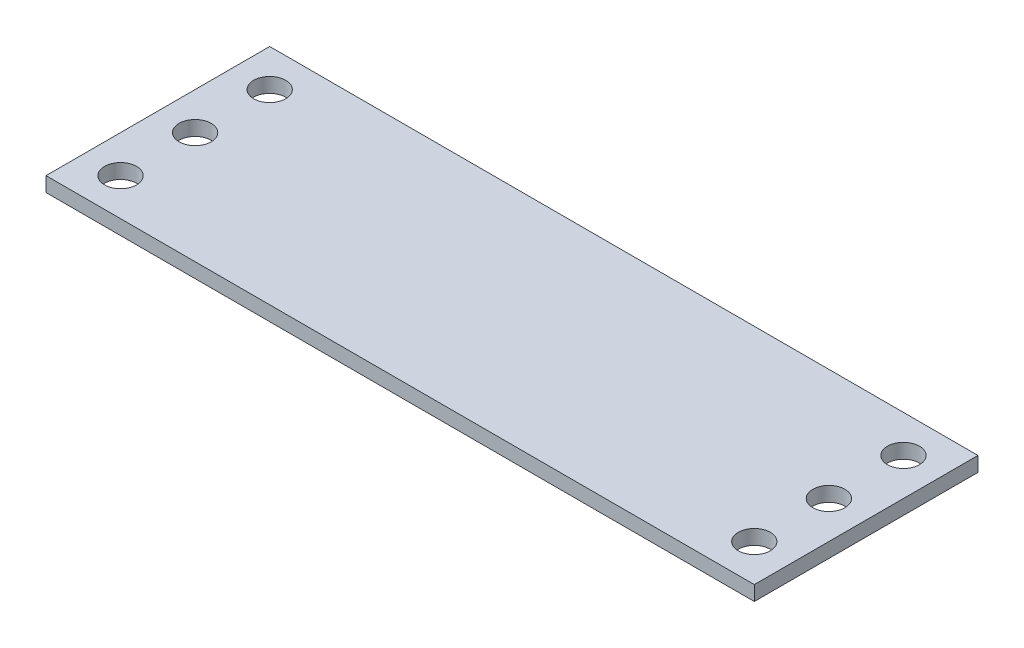
ISO-10303-21;
HEADER;
FILE_DESCRIPTION(('STEP AP214'),'2;1');
FILE_NAME('part.step','',(''),(''),'','','');
FILE_SCHEMA(('AUTOMOTIVE_DESIGN { 1 0 10303 214 1 1 1 1 }'));
ENDSEC;
DATA;
#1=APPLICATION_CONTEXT('core data for automotive mechanical design processes');
#2=APPLICATION_PROTOCOL_DEFINITION('international standard','automotive_design',2000,#1);
#3=PRODUCT_CONTEXT('',#1,'mechanical');
#4=PRODUCT('Part','Part','',(#3));
#5=PRODUCT_RELATED_PRODUCT_CATEGORY('part','',(#4));
#6=PRODUCT_DEFINITION_FORMATION('','',#4);
#7=PRODUCT_DEFINITION_CONTEXT('part definition',#1,'design');
#8=PRODUCT_DEFINITION('design','',#6,#7);
#9=PRODUCT_DEFINITION_SHAPE('','',#8);
#10=(LENGTH_UNIT() NAMED_UNIT(*) SI_UNIT(.MILLI.,.METRE.));
#11=(NAMED_UNIT(*) PLANE_ANGLE_UNIT() SI_UNIT($,.RADIAN.));
#12=(NAMED_UNIT(*) SI_UNIT($,.STERADIAN.) SOLID_ANGLE_UNIT());
#13=UNCERTAINTY_MEASURE_WITH_UNIT(LENGTH_MEASURE(1.E-05),#10,'distance_accuracy_value','');
#14=(GEOMETRIC_REPRESENTATION_CONTEXT(3) GLOBAL_UNCERTAINTY_ASSIGNED_CONTEXT((#13)) GLOBAL_UNIT_ASSIGNED_CONTEXT((#10,
#11,#12)) REPRESENTATION_CONTEXT('',''));
#15=CARTESIAN_POINT('',(0.,0.,0.));
#16=DIRECTION('',(0.,0.,1.));
#17=DIRECTION('',(1.,0.,0.));
#18=AXIS2_PLACEMENT_3D('',#15,#16,#17);
#19=CARTESIAN_POINT('',(24.13,1.,-7.62));
#20=DIRECTION('',(-1.,0.,0.));
#21=DIRECTION('',(0.,0.,1.));
#22=AXIS2_PLACEMENT_3D('',#19,#20,#21);
#23=PLANE('',#22);
#24=DIRECTION('',(0.,0.,-1.));
#25=VECTOR('',#24,1.);
#26=CARTESIAN_POINT('',(24.13,0.,-7.62));
#27=LINE('',#26,#25);
#28=CARTESIAN_POINT('',(24.13,0.,7.62));
#29=VERTEX_POINT('',#28);
#30=CARTESIAN_POINT('',(24.13,0.,-7.62));
#31=VERTEX_POINT('',#30);
#32=EDGE_CURVE('E98',#29,#31,#27,.T.);
#33=ORIENTED_EDGE('',*,*,#32,.T.);
#34=DIRECTION('',(0.,-1.,0.));
#35=VECTOR('',#34,1.);
#36=CARTESIAN_POINT('',(24.13,1.,-7.62));
#37=LINE('',#36,#35);
#38=CARTESIAN_POINT('',(24.13,1.,-7.62));
#39=VERTEX_POINT('',#38);
#40=EDGE_CURVE('E11',#39,#31,#37,.T.);
#41=ORIENTED_EDGE('',*,*,#40,.F.);
#42=DIRECTION('',(0.,0.,-1.));
#43=VECTOR('',#42,1.);
#44=CARTESIAN_POINT('',(24.13,1.,-7.62));
#45=LINE('',#44,#43);
#46=CARTESIAN_POINT('',(24.13,1.,7.62));
#47=VERTEX_POINT('',#46);
#48=EDGE_CURVE('E86',#47,#39,#45,.T.);
#49=ORIENTED_EDGE('',*,*,#48,.F.);
#50=DIRECTION('',(0.,-1.,0.));
#51=VECTOR('',#50,1.);
#52=CARTESIAN_POINT('',(24.13,1.,7.62));
#53=LINE('',#52,#51);
#54=EDGE_CURVE('E94',#47,#29,#53,.T.);
#55=ORIENTED_EDGE('',*,*,#54,.T.);
#56=EDGE_LOOP('',(#33,#41,#49,#55));
#57=FACE_BOUND('',#56,.T.);
#58=ADVANCED_FACE('F35',(#57),#23,.F.);
#59=CARTESIAN_POINT('',(-24.13,1.,-7.62));
#60=DIRECTION('',(0.,0.,1.));
#61=DIRECTION('',(1.,0.,0.));
#62=AXIS2_PLACEMENT_3D('',#59,#60,#61);
#63=PLANE('',#62);
#64=DIRECTION('',(-1.,0.,0.));
#65=VECTOR('',#64,1.);
#66=CARTESIAN_POINT('',(-24.13,0.,-7.62));
#67=LINE('',#66,#65);
#68=CARTESIAN_POINT('',(-24.13,0.,-7.62));
#69=VERTEX_POINT('',#68);
#70=EDGE_CURVE('E90',#31,#69,#67,.T.);
#71=ORIENTED_EDGE('',*,*,#70,.T.);
#72=DIRECTION('',(0.,-1.,0.));
#73=VECTOR('',#72,1.);
#74=CARTESIAN_POINT('',(-24.13,1.,-7.62));
#75=LINE('',#74,#73);
#76=CARTESIAN_POINT('',(-24.13,1.,-7.62));
#77=VERTEX_POINT('',#76);
#78=EDGE_CURVE('E43',#77,#69,#75,.T.);
#79=ORIENTED_EDGE('',*,*,#78,.F.);
#80=DIRECTION('',(-1.,0.,0.));
#81=VECTOR('',#80,1.);
#82=CARTESIAN_POINT('',(-24.13,1.,-7.62));
#83=LINE('',#82,#81);
#84=EDGE_CURVE('E81',#39,#77,#83,.T.);
#85=ORIENTED_EDGE('',*,*,#84,.F.);
#86=ORIENTED_EDGE('',*,*,#40,.T.);
#87=EDGE_LOOP('',(#71,#79,#85,#86));
#88=FACE_BOUND('',#87,.T.);
#89=ADVANCED_FACE('F89',(#88),#63,.F.);
#90=CARTESIAN_POINT('',(-24.13,1.,-7.62));
#91=DIRECTION('',(1.,0.,0.));
#92=DIRECTION('',(0.,0.,-1.));
#93=AXIS2_PLACEMENT_3D('',#90,#91,#92);
#94=PLANE('',#93);
#95=DIRECTION('',(0.,0.,1.));
#96=VECTOR('',#95,1.);
#97=CARTESIAN_POINT('',(-24.13,0.,-7.62));
#98=LINE('',#97,#96);
#99=CARTESIAN_POINT('',(-24.13,0.,7.62));
#100=VERTEX_POINT('',#99);
#101=EDGE_CURVE('E68',#69,#100,#98,.T.);
#102=ORIENTED_EDGE('',*,*,#101,.T.);
#103=DIRECTION('',(0.,-1.,0.));
#104=VECTOR('',#103,1.);
#105=CARTESIAN_POINT('',(-24.13,1.,7.62));
#106=LINE('',#105,#104);
#107=CARTESIAN_POINT('',(-24.13,1.,7.62));
#108=VERTEX_POINT('',#107);
#109=EDGE_CURVE('E91',#108,#100,#106,.T.);
#110=ORIENTED_EDGE('',*,*,#109,.F.);
#111=DIRECTION('',(0.,0.,1.));
#112=VECTOR('',#111,1.);
#113=CARTESIAN_POINT('',(-24.13,1.,-7.62));
#114=LINE('',#113,#112);
#115=EDGE_CURVE('E84',#77,#108,#114,.T.);
#116=ORIENTED_EDGE('',*,*,#115,.F.);
#117=ORIENTED_EDGE('',*,*,#78,.T.);
#118=EDGE_LOOP('',(#102,#110,#116,#117));
#119=FACE_BOUND('',#118,.T.);
#120=ADVANCED_FACE('F92',(#119),#94,.F.);
#121=CARTESIAN_POINT('',(-24.13,1.,7.62));
#122=DIRECTION('',(0.,0.,-1.));
#123=DIRECTION('',(-1.,0.,0.));
#124=AXIS2_PLACEMENT_3D('',#121,#122,#123);
#125=PLANE('',#124);
#126=DIRECTION('',(1.,0.,0.));
#127=VECTOR('',#126,1.);
#128=CARTESIAN_POINT('',(-24.13,0.,7.62));
#129=LINE('',#128,#127);
#130=EDGE_CURVE('E74',#100,#29,#129,.T.);
#131=ORIENTED_EDGE('',*,*,#130,.T.);
#132=ORIENTED_EDGE('',*,*,#54,.F.);
#133=DIRECTION('',(1.,0.,0.));
#134=VECTOR('',#133,1.);
#135=CARTESIAN_POINT('',(-24.13,1.,7.62));
#136=LINE('',#135,#134);
#137=EDGE_CURVE('E51',#108,#47,#136,.T.);
#138=ORIENTED_EDGE('',*,*,#137,.F.);
#139=ORIENTED_EDGE('',*,*,#109,.T.);
#140=EDGE_LOOP('',(#131,#132,#138,#139));
#141=FACE_BOUND('',#140,.T.);
#142=ADVANCED_FACE('F106',(#141),#125,.F.);
#143=CARTESIAN_POINT('',(24.13,1.,7.62));
#144=DIRECTION('',(0.,1.,0.));
#145=DIRECTION('',(0.,0.,1.));
#146=AXIS2_PLACEMENT_3D('',#143,#144,#145);
#147=PLANE('',#146);
#148=CARTESIAN_POINT('',(21.59,1.,-5.07999999999992));
#149=DIRECTION('',(0.,1.,0.));
#150=DIRECTION('',(0.,0.,-1.));
#151=AXIS2_PLACEMENT_3D('',#148,#149,#150);
#152=CIRCLE('',#151,1.0922);
#153=CARTESIAN_POINT('',(21.59,1.,-6.17219999999992));
#154=VERTEX_POINT('',#153);
#155=EDGE_CURVE('E142',#154,#154,#152,.T.);
#156=ORIENTED_EDGE('',*,*,#155,.F.);
#157=EDGE_LOOP('',(#156));
#158=FACE_BOUND('',#157,.T.);
#159=CARTESIAN_POINT('',(21.59,1.,0.));
#160=DIRECTION('',(0.,1.,0.));
#161=DIRECTION('',(0.,0.,-1.));
#162=AXIS2_PLACEMENT_3D('',#159,#160,#161);
#163=CIRCLE('',#162,1.0922);
#164=CARTESIAN_POINT('',(21.59,1.,-1.09219999999992));
#165=VERTEX_POINT('',#164);
#166=EDGE_CURVE('E136',#165,#165,#163,.T.);
#167=ORIENTED_EDGE('',*,*,#166,.F.);
#168=EDGE_LOOP('',(#167));
#169=FACE_BOUND('',#168,.T.);
#170=CARTESIAN_POINT('',(21.59,1.,5.08000000000008));
#171=DIRECTION('',(0.,1.,0.));
#172=DIRECTION('',(0.,0.,-1.));
#173=AXIS2_PLACEMENT_3D('',#170,#171,#172);
#174=CIRCLE('',#173,1.0922);
#175=CARTESIAN_POINT('',(21.59,1.,3.98780000000008));
#176=VERTEX_POINT('',#175);
#177=EDGE_CURVE('E130',#176,#176,#174,.T.);
#178=ORIENTED_EDGE('',*,*,#177,.F.);
#179=EDGE_LOOP('',(#178));
#180=FACE_BOUND('',#179,.T.);
#181=CARTESIAN_POINT('',(-21.59,1.,5.08));
#182=DIRECTION('',(0.,1.,0.));
#183=DIRECTION('',(0.,0.,1.));
#184=AXIS2_PLACEMENT_3D('',#181,#182,#183);
#185=CIRCLE('',#184,1.0922);
#186=CARTESIAN_POINT('',(-21.59,1.,6.1722));
#187=VERTEX_POINT('',#186);
#188=EDGE_CURVE('E124',#187,#187,#185,.T.);
#189=ORIENTED_EDGE('',*,*,#188,.F.);
#190=EDGE_LOOP('',(#189));
#191=FACE_BOUND('',#190,.T.);
#192=CARTESIAN_POINT('',(-21.59,1.,0.));
#193=DIRECTION('',(0.,1.,0.));
#194=DIRECTION('',(0.,0.,1.));
#195=AXIS2_PLACEMENT_3D('',#192,#193,#194);
#196=CIRCLE('',#195,1.0922);
#197=CARTESIAN_POINT('',(-21.59,1.,1.0922));
#198=VERTEX_POINT('',#197);
#199=EDGE_CURVE('E118',#198,#198,#196,.T.);
#200=ORIENTED_EDGE('',*,*,#199,.F.);
#201=EDGE_LOOP('',(#200));
#202=FACE_BOUND('',#201,.T.);
#203=CARTESIAN_POINT('',(-21.59,1.,-5.08));
#204=DIRECTION('',(0.,1.,0.));
#205=DIRECTION('',(0.,0.,1.));
#206=AXIS2_PLACEMENT_3D('',#203,#204,#205);
#207=CIRCLE('',#206,1.0922);
#208=CARTESIAN_POINT('',(-21.59,1.,-3.9878));
#209=VERTEX_POINT('',#208);
#210=EDGE_CURVE('E112',#209,#209,#207,.T.);
#211=ORIENTED_EDGE('',*,*,#210,.F.);
#212=EDGE_LOOP('',(#211));
#213=FACE_BOUND('',#212,.T.);
#214=ORIENTED_EDGE('',*,*,#48,.T.);
#215=ORIENTED_EDGE('',*,*,#84,.T.);
#216=ORIENTED_EDGE('',*,*,#115,.T.);
#217=ORIENTED_EDGE('',*,*,#137,.T.);
#218=EDGE_LOOP('',(#214,#215,#216,#217));
#219=FACE_BOUND('',#218,.T.);
#220=ADVANCED_FACE('F82',(#158,#169,#180,#191,#202,#213,#219),#147,.T.);
#221=CARTESIAN_POINT('',(24.13,0.,7.62));
#222=DIRECTION('',(0.,1.,0.));
#223=DIRECTION('',(0.,0.,1.));
#224=AXIS2_PLACEMENT_3D('',#221,#222,#223);
#225=PLANE('',#224);
#226=CARTESIAN_POINT('',(21.59,0.,-5.07999999999992));
#227=DIRECTION('',(0.,1.,0.));
#228=DIRECTION('',(0.,0.,-1.));
#229=AXIS2_PLACEMENT_3D('',#226,#227,#228);
#230=CIRCLE('',#229,1.0922);
#231=CARTESIAN_POINT('',(21.59,0.,-6.17219999999992));
#232=VERTEX_POINT('',#231);
#233=EDGE_CURVE('E139',#232,#232,#230,.T.);
#234=ORIENTED_EDGE('',*,*,#233,.T.);
#235=EDGE_LOOP('',(#234));
#236=FACE_BOUND('',#235,.T.);
#237=CARTESIAN_POINT('',(21.59,0.,0.));
#238=DIRECTION('',(0.,1.,0.));
#239=DIRECTION('',(0.,0.,-1.));
#240=AXIS2_PLACEMENT_3D('',#237,#238,#239);
#241=CIRCLE('',#240,1.0922);
#242=CARTESIAN_POINT('',(21.59,0.,-1.09219999999992));
#243=VERTEX_POINT('',#242);
#244=EDGE_CURVE('E133',#243,#243,#241,.T.);
#245=ORIENTED_EDGE('',*,*,#244,.T.);
#246=EDGE_LOOP('',(#245));
#247=FACE_BOUND('',#246,.T.);
#248=CARTESIAN_POINT('',(21.59,0.,5.08000000000008));
#249=DIRECTION('',(0.,1.,0.));
#250=DIRECTION('',(0.,0.,-1.));
#251=AXIS2_PLACEMENT_3D('',#248,#249,#250);
#252=CIRCLE('',#251,1.0922);
#253=CARTESIAN_POINT('',(21.59,0.,3.98780000000008));
#254=VERTEX_POINT('',#253);
#255=EDGE_CURVE('E127',#254,#254,#252,.T.);
#256=ORIENTED_EDGE('',*,*,#255,.T.);
#257=EDGE_LOOP('',(#256));
#258=FACE_BOUND('',#257,.T.);
#259=CARTESIAN_POINT('',(-21.59,0.,5.08));
#260=DIRECTION('',(0.,1.,0.));
#261=DIRECTION('',(0.,0.,1.));
#262=AXIS2_PLACEMENT_3D('',#259,#260,#261);
#263=CIRCLE('',#262,1.0922);
#264=CARTESIAN_POINT('',(-21.59,0.,6.1722));
#265=VERTEX_POINT('',#264);
#266=EDGE_CURVE('E121',#265,#265,#263,.T.);
#267=ORIENTED_EDGE('',*,*,#266,.T.);
#268=EDGE_LOOP('',(#267));
#269=FACE_BOUND('',#268,.T.);
#270=CARTESIAN_POINT('',(-21.59,0.,0.));
#271=DIRECTION('',(0.,1.,0.));
#272=DIRECTION('',(0.,0.,1.));
#273=AXIS2_PLACEMENT_3D('',#270,#271,#272);
#274=CIRCLE('',#273,1.0922);
#275=CARTESIAN_POINT('',(-21.59,0.,1.0922));
#276=VERTEX_POINT('',#275);
#277=EDGE_CURVE('E115',#276,#276,#274,.T.);
#278=ORIENTED_EDGE('',*,*,#277,.T.);
#279=EDGE_LOOP('',(#278));
#280=FACE_BOUND('',#279,.T.);
#281=CARTESIAN_POINT('',(-21.59,0.,-5.08));
#282=DIRECTION('',(0.,1.,0.));
#283=DIRECTION('',(0.,0.,1.));
#284=AXIS2_PLACEMENT_3D('',#281,#282,#283);
#285=CIRCLE('',#284,1.0922);
#286=CARTESIAN_POINT('',(-21.59,0.,-3.9878));
#287=VERTEX_POINT('',#286);
#288=EDGE_CURVE('E101',#287,#287,#285,.T.);
#289=ORIENTED_EDGE('',*,*,#288,.T.);
#290=EDGE_LOOP('',(#289));
#291=FACE_BOUND('',#290,.T.);
#292=ORIENTED_EDGE('',*,*,#32,.F.);
#293=ORIENTED_EDGE('',*,*,#130,.F.);
#294=ORIENTED_EDGE('',*,*,#101,.F.);
#295=ORIENTED_EDGE('',*,*,#70,.F.);
#296=EDGE_LOOP('',(#292,#293,#294,#295));
#297=FACE_BOUND('',#296,.T.);
#298=ADVANCED_FACE('F109',(#236,#247,#258,#269,#280,#291,#297),#225,.F.);
#299=CARTESIAN_POINT('',(-21.59,0.,-5.08));
#300=DIRECTION('',(0.,1.,0.));
#301=DIRECTION('',(0.,0.,1.));
#302=AXIS2_PLACEMENT_3D('',#299,#300,#301);
#303=CYLINDRICAL_SURFACE('',#302,1.0922);
#304=ORIENTED_EDGE('',*,*,#288,.F.);
#305=EDGE_LOOP('',(#304));
#306=FACE_BOUND('',#305,.T.);
#307=ORIENTED_EDGE('',*,*,#210,.T.);
#308=EDGE_LOOP('',(#307));
#309=FACE_BOUND('',#308,.T.);
#310=ADVANCED_FACE('F170',(#306,#309),#303,.F.);
#311=CARTESIAN_POINT('',(-21.59,0.,0.));
#312=DIRECTION('',(0.,1.,0.));
#313=DIRECTION('',(0.,0.,1.));
#314=AXIS2_PLACEMENT_3D('',#311,#312,#313);
#315=CYLINDRICAL_SURFACE('',#314,1.0922);
#316=ORIENTED_EDGE('',*,*,#277,.F.);
#317=EDGE_LOOP('',(#316));
#318=FACE_BOUND('',#317,.T.);
#319=ORIENTED_EDGE('',*,*,#199,.T.);
#320=EDGE_LOOP('',(#319));
#321=FACE_BOUND('',#320,.T.);
#322=ADVANCED_FACE('F172',(#318,#321),#315,.F.);
#323=CARTESIAN_POINT('',(-21.59,0.,5.08));
#324=DIRECTION('',(0.,1.,0.));
#325=DIRECTION('',(0.,0.,1.));
#326=AXIS2_PLACEMENT_3D('',#323,#324,#325);
#327=CYLINDRICAL_SURFACE('',#326,1.0922);
#328=ORIENTED_EDGE('',*,*,#266,.F.);
#329=EDGE_LOOP('',(#328));
#330=FACE_BOUND('',#329,.T.);
#331=ORIENTED_EDGE('',*,*,#188,.T.);
#332=EDGE_LOOP('',(#331));
#333=FACE_BOUND('',#332,.T.);
#334=ADVANCED_FACE('F179',(#330,#333),#327,.F.);
#335=CARTESIAN_POINT('',(21.59,0.,5.08000000000008));
#336=DIRECTION('',(0.,1.,0.));
#337=DIRECTION('',(0.,0.,1.));
#338=AXIS2_PLACEMENT_3D('',#335,#336,#337);
#339=CYLINDRICAL_SURFACE('',#338,1.0922);
#340=ORIENTED_EDGE('',*,*,#255,.F.);
#341=EDGE_LOOP('',(#340));
#342=FACE_BOUND('',#341,.T.);
#343=ORIENTED_EDGE('',*,*,#177,.T.);
#344=EDGE_LOOP('',(#343));
#345=FACE_BOUND('',#344,.T.);
#346=ADVANCED_FACE('F225',(#342,#345),#339,.F.);
#347=CARTESIAN_POINT('',(21.59,0.,0.));
#348=DIRECTION('',(0.,1.,0.));
#349=DIRECTION('',(0.,0.,1.));
#350=AXIS2_PLACEMENT_3D('',#347,#348,#349);
#351=CYLINDRICAL_SURFACE('',#350,1.0922);
#352=ORIENTED_EDGE('',*,*,#244,.F.);
#353=EDGE_LOOP('',(#352));
#354=FACE_BOUND('',#353,.T.);
#355=ORIENTED_EDGE('',*,*,#166,.T.);
#356=EDGE_LOOP('',(#355));
#357=FACE_BOUND('',#356,.T.);
#358=ADVANCED_FACE('F153',(#354,#357),#351,.F.);
#359=CARTESIAN_POINT('',(21.59,0.,-5.07999999999992));
#360=DIRECTION('',(0.,1.,0.));
#361=DIRECTION('',(0.,0.,1.));
#362=AXIS2_PLACEMENT_3D('',#359,#360,#361);
#363=CYLINDRICAL_SURFACE('',#362,1.0922);
#364=ORIENTED_EDGE('',*,*,#233,.F.);
#365=EDGE_LOOP('',(#364));
#366=FACE_BOUND('',#365,.T.);
#367=ORIENTED_EDGE('',*,*,#155,.T.);
#368=EDGE_LOOP('',(#367));
#369=FACE_BOUND('',#368,.T.);
#370=ADVANCED_FACE('F150',(#366,#369),#363,.F.);
#371=CLOSED_SHELL('',(#58,#89,#120,#142,#220,#298,#310,#322,#334,#346,#358,#370));
#372=MANIFOLD_SOLID_BREP('B2',#371);
#373=ADVANCED_BREP_SHAPE_REPRESENTATION('',(#18,#372),#14);
#374=SHAPE_DEFINITION_REPRESENTATION(#9,#373);
ENDSEC;
END-ISO-10303-21;
